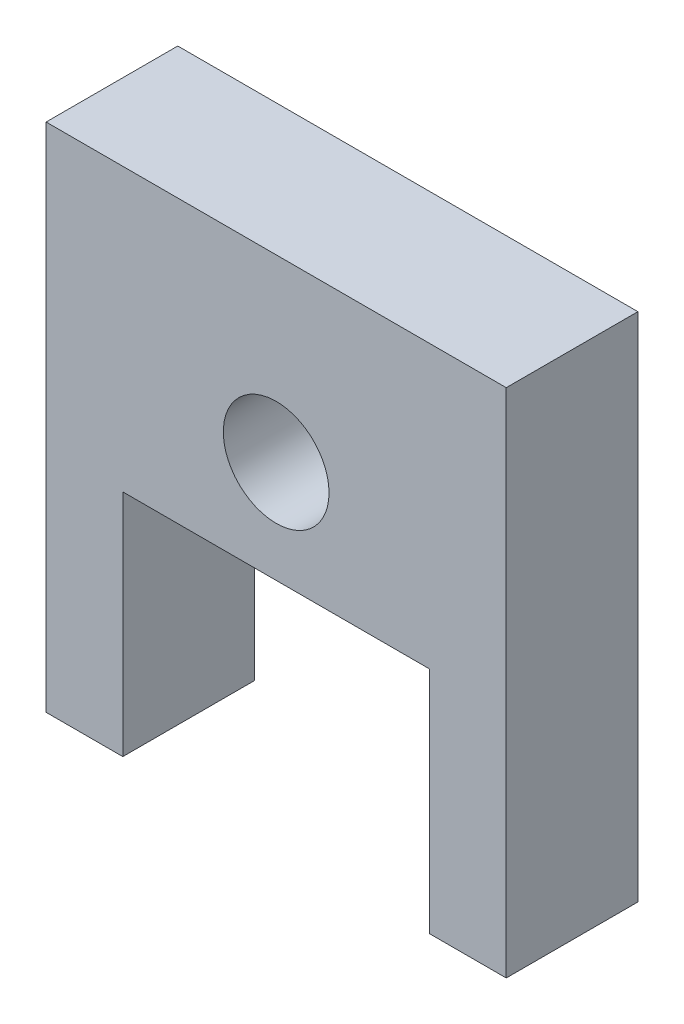
ISO-10303-21;
HEADER;
FILE_DESCRIPTION(('STEP AP214'),'2;1');
FILE_NAME('part.step','',(''),(''),'','','');
FILE_SCHEMA(('AUTOMOTIVE_DESIGN { 1 0 10303 214 1 1 1 1 }'));
ENDSEC;
DATA;
#1=APPLICATION_CONTEXT('core data for automotive mechanical design processes');
#2=APPLICATION_PROTOCOL_DEFINITION('international standard','automotive_design',2000,#1);
#3=PRODUCT_CONTEXT('',#1,'mechanical');
#4=PRODUCT('Part','Part','',(#3));
#5=PRODUCT_RELATED_PRODUCT_CATEGORY('part','',(#4));
#6=PRODUCT_DEFINITION_FORMATION('','',#4);
#7=PRODUCT_DEFINITION_CONTEXT('part definition',#1,'design');
#8=PRODUCT_DEFINITION('design','',#6,#7);
#9=PRODUCT_DEFINITION_SHAPE('','',#8);
#10=(LENGTH_UNIT() NAMED_UNIT(*) SI_UNIT(.MILLI.,.METRE.));
#11=(NAMED_UNIT(*) PLANE_ANGLE_UNIT() SI_UNIT($,.RADIAN.));
#12=(NAMED_UNIT(*) SI_UNIT($,.STERADIAN.) SOLID_ANGLE_UNIT());
#13=UNCERTAINTY_MEASURE_WITH_UNIT(LENGTH_MEASURE(1.E-05),#10,'distance_accuracy_value','');
#14=(GEOMETRIC_REPRESENTATION_CONTEXT(3) GLOBAL_UNCERTAINTY_ASSIGNED_CONTEXT((#13)) GLOBAL_UNIT_ASSIGNED_CONTEXT((#10,
#11,#12)) REPRESENTATION_CONTEXT('',''));
#15=CARTESIAN_POINT('',(0.,0.,0.));
#16=DIRECTION('',(0.,0.,1.));
#17=DIRECTION('',(1.,0.,0.));
#18=AXIS2_PLACEMENT_3D('',#15,#16,#17);
#19=CARTESIAN_POINT('',(0.,20.,5.15));
#20=DIRECTION('',(1.,0.,0.));
#21=DIRECTION('',(0.,0.,-1.));
#22=AXIS2_PLACEMENT_3D('',#19,#20,#21);
#23=PLANE('',#22);
#24=DIRECTION('',(0.,-1.,0.));
#25=VECTOR('',#24,1.);
#26=CARTESIAN_POINT('',(0.,20.,0.));
#27=LINE('',#26,#25);
#28=CARTESIAN_POINT('',(0.,20.,0.));
#29=VERTEX_POINT('',#28);
#30=CARTESIAN_POINT('',(0.,0.,0.));
#31=VERTEX_POINT('',#30);
#32=EDGE_CURVE('E129',#29,#31,#27,.T.);
#33=ORIENTED_EDGE('',*,*,#32,.T.);
#34=DIRECTION('',(0.,0.,-1.));
#35=VECTOR('',#34,1.);
#36=CARTESIAN_POINT('',(0.,0.,5.15));
#37=LINE('',#36,#35);
#38=CARTESIAN_POINT('',(0.,0.,5.15));
#39=VERTEX_POINT('',#38);
#40=EDGE_CURVE('E11',#39,#31,#37,.T.);
#41=ORIENTED_EDGE('',*,*,#40,.F.);
#42=DIRECTION('',(0.,-1.,0.));
#43=VECTOR('',#42,1.);
#44=CARTESIAN_POINT('',(0.,20.,5.15));
#45=LINE('',#44,#43);
#46=CARTESIAN_POINT('',(0.,20.,5.15));
#47=VERTEX_POINT('',#46);
#48=EDGE_CURVE('E144',#47,#39,#45,.T.);
#49=ORIENTED_EDGE('',*,*,#48,.F.);
#50=DIRECTION('',(0.,0.,-1.));
#51=VECTOR('',#50,1.);
#52=CARTESIAN_POINT('',(0.,20.,5.15));
#53=LINE('',#52,#51);
#54=EDGE_CURVE('E125',#47,#29,#53,.T.);
#55=ORIENTED_EDGE('',*,*,#54,.T.);
#56=EDGE_LOOP('',(#33,#41,#49,#55));
#57=FACE_BOUND('',#56,.T.);
#58=ADVANCED_FACE('F33',(#57),#23,.F.);
#59=CARTESIAN_POINT('',(0.,0.,5.15));
#60=DIRECTION('',(0.,1.,0.));
#61=DIRECTION('',(0.,0.,1.));
#62=AXIS2_PLACEMENT_3D('',#59,#60,#61);
#63=PLANE('',#62);
#64=DIRECTION('',(1.,0.,0.));
#65=VECTOR('',#64,1.);
#66=CARTESIAN_POINT('',(0.,0.,0.));
#67=LINE('',#66,#65);
#68=CARTESIAN_POINT('',(3.,0.,0.));
#69=VERTEX_POINT('',#68);
#70=EDGE_CURVE('E132',#31,#69,#67,.T.);
#71=ORIENTED_EDGE('',*,*,#70,.T.);
#72=DIRECTION('',(0.,0.,-1.));
#73=VECTOR('',#72,1.);
#74=CARTESIAN_POINT('',(3.,0.,5.15));
#75=LINE('',#74,#73);
#76=CARTESIAN_POINT('',(3.,0.,5.15));
#77=VERTEX_POINT('',#76);
#78=EDGE_CURVE('E41',#77,#69,#75,.T.);
#79=ORIENTED_EDGE('',*,*,#78,.F.);
#80=DIRECTION('',(1.,0.,0.));
#81=VECTOR('',#80,1.);
#82=CARTESIAN_POINT('',(0.,0.,5.15));
#83=LINE('',#82,#81);
#84=EDGE_CURVE('E92',#39,#77,#83,.T.);
#85=ORIENTED_EDGE('',*,*,#84,.F.);
#86=ORIENTED_EDGE('',*,*,#40,.T.);
#87=EDGE_LOOP('',(#71,#79,#85,#86));
#88=FACE_BOUND('',#87,.T.);
#89=ADVANCED_FACE('F200',(#88),#63,.F.);
#90=CARTESIAN_POINT('',(3.,0.,5.15));
#91=DIRECTION('',(-1.,0.,0.));
#92=DIRECTION('',(0.,0.,1.));
#93=AXIS2_PLACEMENT_3D('',#90,#91,#92);
#94=PLANE('',#93);
#95=DIRECTION('',(0.,1.,0.));
#96=VECTOR('',#95,1.);
#97=CARTESIAN_POINT('',(3.,0.,0.));
#98=LINE('',#97,#96);
#99=CARTESIAN_POINT('',(3.,8.97,0.));
#100=VERTEX_POINT('',#99);
#101=EDGE_CURVE('E135',#69,#100,#98,.T.);
#102=ORIENTED_EDGE('',*,*,#101,.T.);
#103=DIRECTION('',(0.,0.,-1.));
#104=VECTOR('',#103,1.);
#105=CARTESIAN_POINT('',(3.,8.97,5.15));
#106=LINE('',#105,#104);
#107=CARTESIAN_POINT('',(3.,8.97,5.15));
#108=VERTEX_POINT('',#107);
#109=EDGE_CURVE('E151',#108,#100,#106,.T.);
#110=ORIENTED_EDGE('',*,*,#109,.F.);
#111=DIRECTION('',(0.,1.,0.));
#112=VECTOR('',#111,1.);
#113=CARTESIAN_POINT('',(3.,0.,5.15));
#114=LINE('',#113,#112);
#115=EDGE_CURVE('E159',#77,#108,#114,.T.);
#116=ORIENTED_EDGE('',*,*,#115,.F.);
#117=ORIENTED_EDGE('',*,*,#78,.T.);
#118=EDGE_LOOP('',(#102,#110,#116,#117));
#119=FACE_BOUND('',#118,.T.);
#120=ADVANCED_FACE('F157',(#119),#94,.F.);
#121=CARTESIAN_POINT('',(3.,8.97,5.15));
#122=DIRECTION('',(0.,1.,0.));
#123=DIRECTION('',(0.,0.,1.));
#124=AXIS2_PLACEMENT_3D('',#121,#122,#123);
#125=PLANE('',#124);
#126=DIRECTION('',(1.,0.,0.));
#127=VECTOR('',#126,1.);
#128=CARTESIAN_POINT('',(3.,8.97,0.));
#129=LINE('',#128,#127);
#130=CARTESIAN_POINT('',(15.,8.97,0.));
#131=VERTEX_POINT('',#130);
#132=EDGE_CURVE('E137',#100,#131,#129,.T.);
#133=ORIENTED_EDGE('',*,*,#132,.T.);
#134=DIRECTION('',(0.,0.,-1.));
#135=VECTOR('',#134,1.);
#136=CARTESIAN_POINT('',(15.,8.97,5.15));
#137=LINE('',#136,#135);
#138=CARTESIAN_POINT('',(15.,8.97,5.15));
#139=VERTEX_POINT('',#138);
#140=EDGE_CURVE('E148',#139,#131,#137,.T.);
#141=ORIENTED_EDGE('',*,*,#140,.F.);
#142=DIRECTION('',(1.,0.,0.));
#143=VECTOR('',#142,1.);
#144=CARTESIAN_POINT('',(3.,8.97,5.15));
#145=LINE('',#144,#143);
#146=EDGE_CURVE('E171',#108,#139,#145,.T.);
#147=ORIENTED_EDGE('',*,*,#146,.F.);
#148=ORIENTED_EDGE('',*,*,#109,.T.);
#149=EDGE_LOOP('',(#133,#141,#147,#148));
#150=FACE_BOUND('',#149,.T.);
#151=ADVANCED_FACE('F167',(#150),#125,.F.);
#152=CARTESIAN_POINT('',(15.,8.97,5.15));
#153=DIRECTION('',(1.,0.,0.));
#154=DIRECTION('',(0.,1.,0.));
#155=AXIS2_PLACEMENT_3D('',#152,#153,#154);
#156=PLANE('',#155);
#157=DIRECTION('',(0.,-1.,0.));
#158=VECTOR('',#157,1.);
#159=CARTESIAN_POINT('',(15.,8.97,0.));
#160=LINE('',#159,#158);
#161=CARTESIAN_POINT('',(15.,0.,0.));
#162=VERTEX_POINT('',#161);
#163=EDGE_CURVE('E139',#131,#162,#160,.T.);
#164=ORIENTED_EDGE('',*,*,#163,.T.);
#165=DIRECTION('',(0.,0.,-1.));
#166=VECTOR('',#165,1.);
#167=CARTESIAN_POINT('',(15.,0.,5.15));
#168=LINE('',#167,#166);
#169=CARTESIAN_POINT('',(15.,0.,5.15));
#170=VERTEX_POINT('',#169);
#171=EDGE_CURVE('E120',#170,#162,#168,.T.);
#172=ORIENTED_EDGE('',*,*,#171,.F.);
#173=DIRECTION('',(0.,-1.,0.));
#174=VECTOR('',#173,1.);
#175=CARTESIAN_POINT('',(15.,8.97,5.15));
#176=LINE('',#175,#174);
#177=EDGE_CURVE('E111',#139,#170,#176,.T.);
#178=ORIENTED_EDGE('',*,*,#177,.F.);
#179=ORIENTED_EDGE('',*,*,#140,.T.);
#180=EDGE_LOOP('',(#164,#172,#178,#179));
#181=FACE_BOUND('',#180,.T.);
#182=ADVANCED_FACE('F170',(#181),#156,.F.);
#183=CARTESIAN_POINT('',(15.,0.,5.15));
#184=DIRECTION('',(0.,1.,0.));
#185=DIRECTION('',(0.,0.,1.));
#186=AXIS2_PLACEMENT_3D('',#183,#184,#185);
#187=PLANE('',#186);
#188=DIRECTION('',(1.,0.,0.));
#189=VECTOR('',#188,1.);
#190=CARTESIAN_POINT('',(15.,0.,0.));
#191=LINE('',#190,#189);
#192=CARTESIAN_POINT('',(18.,0.,0.));
#193=VERTEX_POINT('',#192);
#194=EDGE_CURVE('E119',#162,#193,#191,.T.);
#195=ORIENTED_EDGE('',*,*,#194,.T.);
#196=DIRECTION('',(0.,0.,-1.));
#197=VECTOR('',#196,1.);
#198=CARTESIAN_POINT('',(18.,0.,5.15));
#199=LINE('',#198,#197);
#200=CARTESIAN_POINT('',(18.,0.,5.15));
#201=VERTEX_POINT('',#200);
#202=EDGE_CURVE('E116',#201,#193,#199,.T.);
#203=ORIENTED_EDGE('',*,*,#202,.F.);
#204=DIRECTION('',(1.,0.,0.));
#205=VECTOR('',#204,1.);
#206=CARTESIAN_POINT('',(15.,0.,5.15));
#207=LINE('',#206,#205);
#208=EDGE_CURVE('E105',#170,#201,#207,.T.);
#209=ORIENTED_EDGE('',*,*,#208,.F.);
#210=ORIENTED_EDGE('',*,*,#171,.T.);
#211=EDGE_LOOP('',(#195,#203,#209,#210));
#212=FACE_BOUND('',#211,.T.);
#213=ADVANCED_FACE('F117',(#212),#187,.F.);
#214=CARTESIAN_POINT('',(18.,0.,5.15));
#215=DIRECTION('',(-1.,0.,0.));
#216=DIRECTION('',(0.,0.,1.));
#217=AXIS2_PLACEMENT_3D('',#214,#215,#216);
#218=PLANE('',#217);
#219=DIRECTION('',(0.,1.,0.));
#220=VECTOR('',#219,1.);
#221=CARTESIAN_POINT('',(18.,0.,0.));
#222=LINE('',#221,#220);
#223=CARTESIAN_POINT('',(18.,20.,0.));
#224=VERTEX_POINT('',#223);
#225=EDGE_CURVE('E78',#193,#224,#222,.T.);
#226=ORIENTED_EDGE('',*,*,#225,.T.);
#227=DIRECTION('',(0.,0.,-1.));
#228=VECTOR('',#227,1.);
#229=CARTESIAN_POINT('',(18.,20.,5.15));
#230=LINE('',#229,#228);
#231=CARTESIAN_POINT('',(18.,20.,5.15));
#232=VERTEX_POINT('',#231);
#233=EDGE_CURVE('E121',#232,#224,#230,.T.);
#234=ORIENTED_EDGE('',*,*,#233,.F.);
#235=DIRECTION('',(0.,1.,0.));
#236=VECTOR('',#235,1.);
#237=CARTESIAN_POINT('',(18.,0.,5.15));
#238=LINE('',#237,#236);
#239=EDGE_CURVE('E109',#201,#232,#238,.T.);
#240=ORIENTED_EDGE('',*,*,#239,.F.);
#241=ORIENTED_EDGE('',*,*,#202,.T.);
#242=EDGE_LOOP('',(#226,#234,#240,#241));
#243=FACE_BOUND('',#242,.T.);
#244=ADVANCED_FACE('F123',(#243),#218,.F.);
#245=CARTESIAN_POINT('',(18.,20.,5.15));
#246=DIRECTION('',(0.,-1.,0.));
#247=DIRECTION('',(1.,0.,0.));
#248=AXIS2_PLACEMENT_3D('',#245,#246,#247);
#249=PLANE('',#248);
#250=DIRECTION('',(-1.,0.,0.));
#251=VECTOR('',#250,1.);
#252=CARTESIAN_POINT('',(18.,20.,0.));
#253=LINE('',#252,#251);
#254=EDGE_CURVE('E84',#224,#29,#253,.T.);
#255=ORIENTED_EDGE('',*,*,#254,.T.);
#256=ORIENTED_EDGE('',*,*,#54,.F.);
#257=DIRECTION('',(-1.,0.,0.));
#258=VECTOR('',#257,1.);
#259=CARTESIAN_POINT('',(18.,20.,5.15));
#260=LINE('',#259,#258);
#261=EDGE_CURVE('E49',#232,#47,#260,.T.);
#262=ORIENTED_EDGE('',*,*,#261,.F.);
#263=ORIENTED_EDGE('',*,*,#233,.T.);
#264=EDGE_LOOP('',(#255,#256,#262,#263));
#265=FACE_BOUND('',#264,.T.);
#266=ADVANCED_FACE('F191',(#265),#249,.F.);
#267=CARTESIAN_POINT('',(0.,0.,5.15));
#268=DIRECTION('',(0.,0.,1.));
#269=DIRECTION('',(1.,0.,0.));
#270=AXIS2_PLACEMENT_3D('',#267,#268,#269);
#271=PLANE('',#270);
#272=CARTESIAN_POINT('',(9.,12.97,5.15));
#273=DIRECTION('',(0.,0.,1.));
#274=DIRECTION('',(1.,0.,0.));
#275=AXIS2_PLACEMENT_3D('',#272,#273,#274);
#276=CIRCLE('',#275,2.0675);
#277=CARTESIAN_POINT('',(11.0675,12.97,5.15));
#278=VERTEX_POINT('',#277);
#279=EDGE_CURVE('E177',#278,#278,#276,.T.);
#280=ORIENTED_EDGE('',*,*,#279,.F.);
#281=EDGE_LOOP('',(#280));
#282=FACE_BOUND('',#281,.T.);
#283=ORIENTED_EDGE('',*,*,#48,.T.);
#284=ORIENTED_EDGE('',*,*,#84,.T.);
#285=ORIENTED_EDGE('',*,*,#115,.T.);
#286=ORIENTED_EDGE('',*,*,#146,.T.);
#287=ORIENTED_EDGE('',*,*,#177,.T.);
#288=ORIENTED_EDGE('',*,*,#208,.T.);
#289=ORIENTED_EDGE('',*,*,#239,.T.);
#290=ORIENTED_EDGE('',*,*,#261,.T.);
#291=EDGE_LOOP('',(#283,#284,#285,#286,#287,#288,#289,#290));
#292=FACE_BOUND('',#291,.T.);
#293=ADVANCED_FACE('F107',(#282,#292),#271,.T.);
#294=CARTESIAN_POINT('',(0.,0.,0.));
#295=DIRECTION('',(0.,0.,1.));
#296=DIRECTION('',(1.,0.,0.));
#297=AXIS2_PLACEMENT_3D('',#294,#295,#296);
#298=PLANE('',#297);
#299=CARTESIAN_POINT('',(9.,12.97,0.));
#300=DIRECTION('',(0.,0.,1.));
#301=DIRECTION('',(1.,0.,0.));
#302=AXIS2_PLACEMENT_3D('',#299,#300,#301);
#303=CIRCLE('',#302,2.0675);
#304=CARTESIAN_POINT('',(11.0675,12.97,0.));
#305=VERTEX_POINT('',#304);
#306=EDGE_CURVE('E133',#305,#305,#303,.T.);
#307=ORIENTED_EDGE('',*,*,#306,.T.);
#308=EDGE_LOOP('',(#307));
#309=FACE_BOUND('',#308,.T.);
#310=ORIENTED_EDGE('',*,*,#32,.F.);
#311=ORIENTED_EDGE('',*,*,#254,.F.);
#312=ORIENTED_EDGE('',*,*,#225,.F.);
#313=ORIENTED_EDGE('',*,*,#194,.F.);
#314=ORIENTED_EDGE('',*,*,#163,.F.);
#315=ORIENTED_EDGE('',*,*,#132,.F.);
#316=ORIENTED_EDGE('',*,*,#101,.F.);
#317=ORIENTED_EDGE('',*,*,#70,.F.);
#318=EDGE_LOOP('',(#310,#311,#312,#313,#314,#315,#316,#317));
#319=FACE_BOUND('',#318,.T.);
#320=ADVANCED_FACE('F163',(#309,#319),#298,.F.);
#321=CARTESIAN_POINT('',(9.,12.97,0.));
#322=DIRECTION('',(0.,0.,1.));
#323=DIRECTION('',(1.,0.,0.));
#324=AXIS2_PLACEMENT_3D('',#321,#322,#323);
#325=CYLINDRICAL_SURFACE('',#324,2.0675);
#326=ORIENTED_EDGE('',*,*,#306,.F.);
#327=EDGE_LOOP('',(#326));
#328=FACE_BOUND('',#327,.T.);
#329=ORIENTED_EDGE('',*,*,#279,.T.);
#330=EDGE_LOOP('',(#329));
#331=FACE_BOUND('',#330,.T.);
#332=ADVANCED_FACE('F184',(#328,#331),#325,.F.);
#333=CLOSED_SHELL('',(#58,#89,#120,#151,#182,#213,#244,#266,#293,#320,#332));
#334=MANIFOLD_SOLID_BREP('B2',#333);
#335=ADVANCED_BREP_SHAPE_REPRESENTATION('',(#18,#334),#14);
#336=SHAPE_DEFINITION_REPRESENTATION(#9,#335);
ENDSEC;
END-ISO-10303-21;
